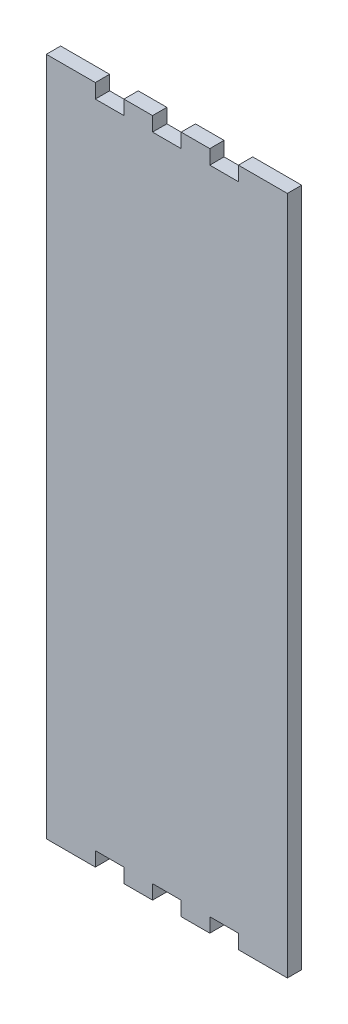
ISO-10303-21;
HEADER;
FILE_DESCRIPTION(('STEP AP214'),'2;1');
FILE_NAME('part.step','',(''),(''),'','','');
FILE_SCHEMA(('AUTOMOTIVE_DESIGN { 1 0 10303 214 1 1 1 1 }'));
ENDSEC;
DATA;
#1=APPLICATION_CONTEXT('core data for automotive mechanical design processes');
#2=APPLICATION_PROTOCOL_DEFINITION('international standard','automotive_design',2000,#1);
#3=PRODUCT_CONTEXT('',#1,'mechanical');
#4=PRODUCT('Part','Part','',(#3));
#5=PRODUCT_RELATED_PRODUCT_CATEGORY('part','',(#4));
#6=PRODUCT_DEFINITION_FORMATION('','',#4);
#7=PRODUCT_DEFINITION_CONTEXT('part definition',#1,'design');
#8=PRODUCT_DEFINITION('design','',#6,#7);
#9=PRODUCT_DEFINITION_SHAPE('','',#8);
#10=(LENGTH_UNIT() NAMED_UNIT(*) SI_UNIT(.MILLI.,.METRE.));
#11=(NAMED_UNIT(*) PLANE_ANGLE_UNIT() SI_UNIT($,.RADIAN.));
#12=(NAMED_UNIT(*) SI_UNIT($,.STERADIAN.) SOLID_ANGLE_UNIT());
#13=UNCERTAINTY_MEASURE_WITH_UNIT(LENGTH_MEASURE(1.E-05),#10,'distance_accuracy_value','');
#14=(GEOMETRIC_REPRESENTATION_CONTEXT(3) GLOBAL_UNCERTAINTY_ASSIGNED_CONTEXT((#13)) GLOBAL_UNIT_ASSIGNED_CONTEXT((#10,
#11,#12)) REPRESENTATION_CONTEXT('',''));
#15=CARTESIAN_POINT('',(0.,0.,0.));
#16=DIRECTION('',(0.,0.,1.));
#17=DIRECTION('',(1.,0.,0.));
#18=AXIS2_PLACEMENT_3D('',#15,#16,#17);
#19=CARTESIAN_POINT('',(980.653875549701,22.8602386986977,5.715));
#20=DIRECTION('',(0.,1.,0.));
#21=DIRECTION('',(0.,0.,1.));
#22=AXIS2_PLACEMENT_3D('',#19,#20,#21);
#23=PLANE('',#22);
#24=DIRECTION('',(1.,0.,0.));
#25=VECTOR('',#24,1.);
#26=CARTESIAN_POINT('',(980.653875549701,22.8602386986977,0.));
#27=LINE('',#26,#25);
#28=CARTESIAN_POINT('',(974.93851469358,22.8602386986977,0.));
#29=VERTEX_POINT('',#28);
#30=CARTESIAN_POINT('',(994.504678765185,22.8602386986977,0.));
#31=VERTEX_POINT('',#30);
#32=EDGE_CURVE('E142',#29,#31,#27,.T.);
#33=ORIENTED_EDGE('',*,*,#32,.T.);
#34=DIRECTION('',(0.,0.,-1.));
#35=VECTOR('',#34,1.);
#36=CARTESIAN_POINT('',(994.504678765185,22.8602386986977,5.715));
#37=LINE('',#36,#35);
#38=CARTESIAN_POINT('',(994.504678765185,22.8602386986977,5.715));
#39=VERTEX_POINT('',#38);
#40=EDGE_CURVE('E11',#39,#31,#37,.T.);
#41=ORIENTED_EDGE('',*,*,#40,.F.);
#42=DIRECTION('',(1.,0.,0.));
#43=VECTOR('',#42,1.);
#44=CARTESIAN_POINT('',(974.93851469358,22.8602386986977,5.715));
#45=LINE('',#44,#43);
#46=CARTESIAN_POINT('',(974.93851469358,22.8602386986977,5.715));
#47=VERTEX_POINT('',#46);
#48=EDGE_CURVE('E147',#47,#39,#45,.T.);
#49=ORIENTED_EDGE('',*,*,#48,.F.);
#50=DIRECTION('',(0.,0.,-1.));
#51=VECTOR('',#50,1.);
#52=CARTESIAN_POINT('',(974.93851469358,22.8602386986977,5.715));
#53=LINE('',#52,#51);
#54=EDGE_CURVE('E246',#47,#29,#53,.T.);
#55=ORIENTED_EDGE('',*,*,#54,.T.);
#56=EDGE_LOOP('',(#33,#41,#49,#55));
#57=FACE_BOUND('',#56,.T.);
#58=ADVANCED_FACE('F34',(#57),#23,.F.);
#59=CARTESIAN_POINT('',(994.504678765185,22.8602386986977,5.715));
#60=DIRECTION('',(-1.,0.,0.));
#61=DIRECTION('',(0.,0.,1.));
#62=AXIS2_PLACEMENT_3D('',#59,#60,#61);
#63=PLANE('',#62);
#64=DIRECTION('',(0.,1.,0.));
#65=VECTOR('',#64,1.);
#66=CARTESIAN_POINT('',(994.504678765185,22.8602386986977,0.));
#67=LINE('',#66,#65);
#68=CARTESIAN_POINT('',(994.504678765185,28.5752452237052,0.));
#69=VERTEX_POINT('',#68);
#70=EDGE_CURVE('E251',#31,#69,#67,.T.);
#71=ORIENTED_EDGE('',*,*,#70,.T.);
#72=DIRECTION('',(0.,0.,-1.));
#73=VECTOR('',#72,1.);
#74=CARTESIAN_POINT('',(994.504678765185,28.5752452237052,5.715));
#75=LINE('',#74,#73);
#76=CARTESIAN_POINT('',(994.504678765185,28.5752452237052,5.715));
#77=VERTEX_POINT('',#76);
#78=EDGE_CURVE('E42',#77,#69,#75,.T.);
#79=ORIENTED_EDGE('',*,*,#78,.F.);
#80=DIRECTION('',(0.,1.,0.));
#81=VECTOR('',#80,1.);
#82=CARTESIAN_POINT('',(994.504678765185,22.8602386986977,5.715));
#83=LINE('',#82,#81);
#84=EDGE_CURVE('E454',#39,#77,#83,.T.);
#85=ORIENTED_EDGE('',*,*,#84,.F.);
#86=ORIENTED_EDGE('',*,*,#40,.T.);
#87=EDGE_LOOP('',(#71,#79,#85,#86));
#88=FACE_BOUND('',#87,.T.);
#89=ADVANCED_FACE('F457',(#88),#63,.F.);
#90=CARTESIAN_POINT('',(994.504678765185,28.5752452237052,5.715));
#91=DIRECTION('',(0.,1.,0.));
#92=DIRECTION('',(0.,0.,1.));
#93=AXIS2_PLACEMENT_3D('',#90,#91,#92);
#94=PLANE('',#93);
#95=DIRECTION('',(1.,0.,0.));
#96=VECTOR('',#95,1.);
#97=CARTESIAN_POINT('',(994.504678765185,28.5752452237052,0.));
#98=LINE('',#97,#96);
#99=CARTESIAN_POINT('',(1005.93540047743,28.5752452237052,0.));
#100=VERTEX_POINT('',#99);
#101=EDGE_CURVE('E253',#69,#100,#98,.T.);
#102=ORIENTED_EDGE('',*,*,#101,.T.);
#103=DIRECTION('',(0.,0.,-1.));
#104=VECTOR('',#103,1.);
#105=CARTESIAN_POINT('',(1005.93540047743,28.5752452237052,5.715));
#106=LINE('',#105,#104);
#107=CARTESIAN_POINT('',(1005.93540047743,28.5752452237052,5.715));
#108=VERTEX_POINT('',#107);
#109=EDGE_CURVE('E373',#108,#100,#106,.T.);
#110=ORIENTED_EDGE('',*,*,#109,.F.);
#111=DIRECTION('',(1.,0.,0.));
#112=VECTOR('',#111,1.);
#113=CARTESIAN_POINT('',(994.504678765185,28.5752452237052,5.715));
#114=LINE('',#113,#112);
#115=EDGE_CURVE('E382',#77,#108,#114,.T.);
#116=ORIENTED_EDGE('',*,*,#115,.F.);
#117=ORIENTED_EDGE('',*,*,#78,.T.);
#118=EDGE_LOOP('',(#102,#110,#116,#117));
#119=FACE_BOUND('',#118,.T.);
#120=ADVANCED_FACE('F380',(#119),#94,.F.);
#121=CARTESIAN_POINT('',(1005.93540047743,28.5752452237052,5.715));
#122=DIRECTION('',(1.,0.,0.));
#123=DIRECTION('',(0.,0.,-1.));
#124=AXIS2_PLACEMENT_3D('',#121,#122,#123);
#125=PLANE('',#124);
#126=DIRECTION('',(0.,-1.,0.));
#127=VECTOR('',#126,1.);
#128=CARTESIAN_POINT('',(1005.93540047743,28.5752452237052,0.));
#129=LINE('',#128,#127);
#130=CARTESIAN_POINT('',(1005.93540047743,22.8602386986977,0.));
#131=VERTEX_POINT('',#130);
#132=EDGE_CURVE('E255',#100,#131,#129,.T.);
#133=ORIENTED_EDGE('',*,*,#132,.T.);
#134=DIRECTION('',(0.,0.,-1.));
#135=VECTOR('',#134,1.);
#136=CARTESIAN_POINT('',(1005.93540047743,22.8602386986977,5.715));
#137=LINE('',#136,#135);
#138=CARTESIAN_POINT('',(1005.93540047743,22.8602386986977,5.715));
#139=VERTEX_POINT('',#138);
#140=EDGE_CURVE('E370',#139,#131,#137,.T.);
#141=ORIENTED_EDGE('',*,*,#140,.F.);
#142=DIRECTION('',(0.,-1.,0.));
#143=VECTOR('',#142,1.);
#144=CARTESIAN_POINT('',(1005.93540047743,28.5752452237052,5.715));
#145=LINE('',#144,#143);
#146=EDGE_CURVE('E400',#108,#139,#145,.T.);
#147=ORIENTED_EDGE('',*,*,#146,.F.);
#148=ORIENTED_EDGE('',*,*,#109,.T.);
#149=EDGE_LOOP('',(#133,#141,#147,#148));
#150=FACE_BOUND('',#149,.T.);
#151=ADVANCED_FACE('F391',(#150),#125,.F.);
#152=CARTESIAN_POINT('',(1005.93540047743,22.8602386986977,5.715));
#153=DIRECTION('',(0.,1.,0.));
#154=DIRECTION('',(0.,0.,1.));
#155=AXIS2_PLACEMENT_3D('',#152,#153,#154);
#156=PLANE('',#155);
#157=DIRECTION('',(1.,0.,0.));
#158=VECTOR('',#157,1.);
#159=CARTESIAN_POINT('',(1005.93540047743,22.8602386986977,0.));
#160=LINE('',#159,#158);
#161=CARTESIAN_POINT('',(1017.36612218967,22.8602386986977,0.));
#162=VERTEX_POINT('',#161);
#163=EDGE_CURVE('E257',#131,#162,#160,.T.);
#164=ORIENTED_EDGE('',*,*,#163,.T.);
#165=DIRECTION('',(0.,0.,-1.));
#166=VECTOR('',#165,1.);
#167=CARTESIAN_POINT('',(1017.36612218967,22.8602386986977,5.715));
#168=LINE('',#167,#166);
#169=CARTESIAN_POINT('',(1017.36612218967,22.8602386986977,5.715));
#170=VERTEX_POINT('',#169);
#171=EDGE_CURVE('E367',#170,#162,#168,.T.);
#172=ORIENTED_EDGE('',*,*,#171,.F.);
#173=DIRECTION('',(1.,0.,0.));
#174=VECTOR('',#173,1.);
#175=CARTESIAN_POINT('',(1005.93540047743,22.8602386986977,5.715));
#176=LINE('',#175,#174);
#177=EDGE_CURVE('E397',#139,#170,#176,.T.);
#178=ORIENTED_EDGE('',*,*,#177,.F.);
#179=ORIENTED_EDGE('',*,*,#140,.T.);
#180=EDGE_LOOP('',(#164,#172,#178,#179));
#181=FACE_BOUND('',#180,.T.);
#182=ADVANCED_FACE('F395',(#181),#156,.F.);
#183=CARTESIAN_POINT('',(1017.36612218967,22.8602386986977,5.715));
#184=DIRECTION('',(-1.,0.,0.));
#185=DIRECTION('',(0.,0.,1.));
#186=AXIS2_PLACEMENT_3D('',#183,#184,#185);
#187=PLANE('',#186);
#188=DIRECTION('',(0.,1.,0.));
#189=VECTOR('',#188,1.);
#190=CARTESIAN_POINT('',(1017.36612218967,22.8602386986977,0.));
#191=LINE('',#190,#189);
#192=CARTESIAN_POINT('',(1017.36612218967,28.5752452237052,0.));
#193=VERTEX_POINT('',#192);
#194=EDGE_CURVE('E259',#162,#193,#191,.T.);
#195=ORIENTED_EDGE('',*,*,#194,.T.);
#196=DIRECTION('',(0.,0.,-1.));
#197=VECTOR('',#196,1.);
#198=CARTESIAN_POINT('',(1017.36612218967,28.5752452237052,5.715));
#199=LINE('',#198,#197);
#200=CARTESIAN_POINT('',(1017.36612218967,28.5752452237052,5.715));
#201=VERTEX_POINT('',#200);
#202=EDGE_CURVE('E364',#201,#193,#199,.T.);
#203=ORIENTED_EDGE('',*,*,#202,.F.);
#204=DIRECTION('',(0.,1.,0.));
#205=VECTOR('',#204,1.);
#206=CARTESIAN_POINT('',(1017.36612218967,22.8602386986977,5.715));
#207=LINE('',#206,#205);
#208=EDGE_CURVE('E399',#170,#201,#207,.T.);
#209=ORIENTED_EDGE('',*,*,#208,.F.);
#210=ORIENTED_EDGE('',*,*,#171,.T.);
#211=EDGE_LOOP('',(#195,#203,#209,#210));
#212=FACE_BOUND('',#211,.T.);
#213=ADVANCED_FACE('F469',(#212),#187,.F.);
#214=CARTESIAN_POINT('',(1017.36612218967,28.5752452237052,5.715));
#215=DIRECTION('',(0.,1.,0.));
#216=DIRECTION('',(0.,0.,1.));
#217=AXIS2_PLACEMENT_3D('',#214,#215,#216);
#218=PLANE('',#217);
#219=DIRECTION('',(1.,0.,0.));
#220=VECTOR('',#219,1.);
#221=CARTESIAN_POINT('',(1017.36612218967,28.5752452237052,0.));
#222=LINE('',#221,#220);
#223=CARTESIAN_POINT('',(1028.79684390191,28.5752452237052,0.));
#224=VERTEX_POINT('',#223);
#225=EDGE_CURVE('E261',#193,#224,#222,.T.);
#226=ORIENTED_EDGE('',*,*,#225,.T.);
#227=DIRECTION('',(0.,0.,-1.));
#228=VECTOR('',#227,1.);
#229=CARTESIAN_POINT('',(1028.79684390191,28.5752452237052,5.715));
#230=LINE('',#229,#228);
#231=CARTESIAN_POINT('',(1028.79684390191,28.5752452237052,5.715));
#232=VERTEX_POINT('',#231);
#233=EDGE_CURVE('E361',#232,#224,#230,.T.);
#234=ORIENTED_EDGE('',*,*,#233,.F.);
#235=DIRECTION('',(1.,0.,0.));
#236=VECTOR('',#235,1.);
#237=CARTESIAN_POINT('',(1017.36612218967,28.5752452237052,5.715));
#238=LINE('',#237,#236);
#239=EDGE_CURVE('E402',#201,#232,#238,.T.);
#240=ORIENTED_EDGE('',*,*,#239,.F.);
#241=ORIENTED_EDGE('',*,*,#202,.T.);
#242=EDGE_LOOP('',(#226,#234,#240,#241));
#243=FACE_BOUND('',#242,.T.);
#244=ADVANCED_FACE('F472',(#243),#218,.F.);
#245=CARTESIAN_POINT('',(1028.79684390191,28.5752452237052,5.715));
#246=DIRECTION('',(1.,0.,0.));
#247=DIRECTION('',(0.,0.,-1.));
#248=AXIS2_PLACEMENT_3D('',#245,#246,#247);
#249=PLANE('',#248);
#250=DIRECTION('',(0.,-1.,0.));
#251=VECTOR('',#250,1.);
#252=CARTESIAN_POINT('',(1028.79684390191,28.5752452237052,0.));
#253=LINE('',#252,#251);
#254=CARTESIAN_POINT('',(1028.79684390191,22.8602386986977,0.));
#255=VERTEX_POINT('',#254);
#256=EDGE_CURVE('E263',#224,#255,#253,.T.);
#257=ORIENTED_EDGE('',*,*,#256,.T.);
#258=DIRECTION('',(0.,0.,-1.));
#259=VECTOR('',#258,1.);
#260=CARTESIAN_POINT('',(1028.79684390191,22.8602386986977,5.715));
#261=LINE('',#260,#259);
#262=CARTESIAN_POINT('',(1028.79684390191,22.8602386986977,5.715));
#263=VERTEX_POINT('',#262);
#264=EDGE_CURVE('E358',#263,#255,#261,.T.);
#265=ORIENTED_EDGE('',*,*,#264,.F.);
#266=DIRECTION('',(0.,-1.,0.));
#267=VECTOR('',#266,1.);
#268=CARTESIAN_POINT('',(1028.79684390191,28.5752452237052,5.715));
#269=LINE('',#268,#267);
#270=EDGE_CURVE('E408',#232,#263,#269,.T.);
#271=ORIENTED_EDGE('',*,*,#270,.F.);
#272=ORIENTED_EDGE('',*,*,#233,.T.);
#273=EDGE_LOOP('',(#257,#265,#271,#272));
#274=FACE_BOUND('',#273,.T.);
#275=ADVANCED_FACE('F476',(#274),#249,.F.);
#276=CARTESIAN_POINT('',(1028.79684390191,22.8602386986977,5.715));
#277=DIRECTION('',(0.,1.,0.));
#278=DIRECTION('',(0.,0.,1.));
#279=AXIS2_PLACEMENT_3D('',#276,#277,#278);
#280=PLANE('',#279);
#281=DIRECTION('',(1.,0.,0.));
#282=VECTOR('',#281,1.);
#283=CARTESIAN_POINT('',(1028.79684390191,22.8602386986977,0.));
#284=LINE('',#283,#282);
#285=CARTESIAN_POINT('',(1040.22402230302,22.8602386986977,0.));
#286=VERTEX_POINT('',#285);
#287=EDGE_CURVE('E265',#255,#286,#284,.T.);
#288=ORIENTED_EDGE('',*,*,#287,.T.);
#289=DIRECTION('',(0.,0.,-1.));
#290=VECTOR('',#289,1.);
#291=CARTESIAN_POINT('',(1040.22402230302,22.8602386986977,5.715));
#292=LINE('',#291,#290);
#293=CARTESIAN_POINT('',(1040.22402230302,22.8602386986977,5.715));
#294=VERTEX_POINT('',#293);
#295=EDGE_CURVE('E355',#294,#286,#292,.T.);
#296=ORIENTED_EDGE('',*,*,#295,.F.);
#297=DIRECTION('',(1.,0.,0.));
#298=VECTOR('',#297,1.);
#299=CARTESIAN_POINT('',(1028.79684390191,22.8602386986977,5.715));
#300=LINE('',#299,#298);
#301=EDGE_CURVE('E410',#263,#294,#300,.T.);
#302=ORIENTED_EDGE('',*,*,#301,.F.);
#303=ORIENTED_EDGE('',*,*,#264,.T.);
#304=EDGE_LOOP('',(#288,#296,#302,#303));
#305=FACE_BOUND('',#304,.T.);
#306=ADVANCED_FACE('F480',(#305),#280,.F.);
#307=CARTESIAN_POINT('',(1040.22402230302,22.8602386986977,5.715));
#308=DIRECTION('',(-1.,0.,0.));
#309=DIRECTION('',(0.,0.,1.));
#310=AXIS2_PLACEMENT_3D('',#307,#308,#309);
#311=PLANE('',#310);
#312=DIRECTION('',(0.,1.,0.));
#313=VECTOR('',#312,1.);
#314=CARTESIAN_POINT('',(1040.22402230302,22.8602386986977,0.));
#315=LINE('',#314,#313);
#316=CARTESIAN_POINT('',(1040.22402230302,28.5752452237052,0.));
#317=VERTEX_POINT('',#316);
#318=EDGE_CURVE('E267',#286,#317,#315,.T.);
#319=ORIENTED_EDGE('',*,*,#318,.T.);
#320=DIRECTION('',(0.,0.,-1.));
#321=VECTOR('',#320,1.);
#322=CARTESIAN_POINT('',(1040.22402230302,28.5752452237052,5.715));
#323=LINE('',#322,#321);
#324=CARTESIAN_POINT('',(1040.22402230302,28.5752452237052,5.715));
#325=VERTEX_POINT('',#324);
#326=EDGE_CURVE('E352',#325,#317,#323,.T.);
#327=ORIENTED_EDGE('',*,*,#326,.F.);
#328=DIRECTION('',(0.,1.,0.));
#329=VECTOR('',#328,1.);
#330=CARTESIAN_POINT('',(1040.22402230302,22.8602386986977,5.715));
#331=LINE('',#330,#329);
#332=EDGE_CURVE('E412',#294,#325,#331,.T.);
#333=ORIENTED_EDGE('',*,*,#332,.F.);
#334=ORIENTED_EDGE('',*,*,#295,.T.);
#335=EDGE_LOOP('',(#319,#327,#333,#334));
#336=FACE_BOUND('',#335,.T.);
#337=ADVANCED_FACE('F484',(#336),#311,.F.);
#338=CARTESIAN_POINT('',(1040.22402230302,28.5752452237052,5.715));
#339=DIRECTION('',(0.,1.,0.));
#340=DIRECTION('',(0.,0.,1.));
#341=AXIS2_PLACEMENT_3D('',#338,#339,#340);
#342=PLANE('',#341);
#343=DIRECTION('',(1.,0.,0.));
#344=VECTOR('',#343,1.);
#345=CARTESIAN_POINT('',(1040.22402230302,28.5752452237052,0.));
#346=LINE('',#345,#344);
#347=CARTESIAN_POINT('',(1051.65474401526,28.5752452237052,0.));
#348=VERTEX_POINT('',#347);
#349=EDGE_CURVE('E269',#317,#348,#346,.T.);
#350=ORIENTED_EDGE('',*,*,#349,.T.);
#351=DIRECTION('',(0.,0.,-1.));
#352=VECTOR('',#351,1.);
#353=CARTESIAN_POINT('',(1051.65474401526,28.5752452237052,5.715));
#354=LINE('',#353,#352);
#355=CARTESIAN_POINT('',(1051.65474401526,28.5752452237052,5.715));
#356=VERTEX_POINT('',#355);
#357=EDGE_CURVE('E349',#356,#348,#354,.T.);
#358=ORIENTED_EDGE('',*,*,#357,.F.);
#359=DIRECTION('',(1.,0.,0.));
#360=VECTOR('',#359,1.);
#361=CARTESIAN_POINT('',(1040.22402230302,28.5752452237052,5.715));
#362=LINE('',#361,#360);
#363=EDGE_CURVE('E414',#325,#356,#362,.T.);
#364=ORIENTED_EDGE('',*,*,#363,.F.);
#365=ORIENTED_EDGE('',*,*,#326,.T.);
#366=EDGE_LOOP('',(#350,#358,#364,#365));
#367=FACE_BOUND('',#366,.T.);
#368=ADVANCED_FACE('F488',(#367),#342,.F.);
#369=CARTESIAN_POINT('',(1051.65474401526,28.5752452237052,5.715));
#370=DIRECTION('',(1.,0.,0.));
#371=DIRECTION('',(0.,0.,-1.));
#372=AXIS2_PLACEMENT_3D('',#369,#370,#371);
#373=PLANE('',#372);
#374=DIRECTION('',(0.,-1.,0.));
#375=VECTOR('',#374,1.);
#376=CARTESIAN_POINT('',(1051.65474401526,28.5752452237052,0.));
#377=LINE('',#376,#375);
#378=CARTESIAN_POINT('',(1051.65474401526,22.8602386986977,0.));
#379=VERTEX_POINT('',#378);
#380=EDGE_CURVE('E271',#348,#379,#377,.T.);
#381=ORIENTED_EDGE('',*,*,#380,.T.);
#382=DIRECTION('',(0.,0.,-1.));
#383=VECTOR('',#382,1.);
#384=CARTESIAN_POINT('',(1051.65474401526,22.8602386986977,5.715));
#385=LINE('',#384,#383);
#386=CARTESIAN_POINT('',(1051.65474401526,22.8602386986977,5.715));
#387=VERTEX_POINT('',#386);
#388=EDGE_CURVE('E346',#387,#379,#385,.T.);
#389=ORIENTED_EDGE('',*,*,#388,.F.);
#390=DIRECTION('',(0.,-1.,0.));
#391=VECTOR('',#390,1.);
#392=CARTESIAN_POINT('',(1051.65474401526,28.5752452237052,5.715));
#393=LINE('',#392,#391);
#394=EDGE_CURVE('E416',#356,#387,#393,.T.);
#395=ORIENTED_EDGE('',*,*,#394,.F.);
#396=ORIENTED_EDGE('',*,*,#357,.T.);
#397=EDGE_LOOP('',(#381,#389,#395,#396));
#398=FACE_BOUND('',#397,.T.);
#399=ADVANCED_FACE('F492',(#398),#373,.F.);
#400=CARTESIAN_POINT('',(1065.50909054188,22.8602386986977,5.715));
#401=DIRECTION('',(0.,1.,0.));
#402=DIRECTION('',(0.,0.,1.));
#403=AXIS2_PLACEMENT_3D('',#400,#401,#402);
#404=PLANE('',#403);
#405=DIRECTION('',(1.,0.,0.));
#406=VECTOR('',#405,1.);
#407=CARTESIAN_POINT('',(1065.50909054188,22.8602386986977,0.));
#408=LINE('',#407,#406);
#409=CARTESIAN_POINT('',(1071.22090808686,22.8602386986977,0.));
#410=VERTEX_POINT('',#409);
#411=EDGE_CURVE('E274',#379,#410,#408,.T.);
#412=ORIENTED_EDGE('',*,*,#411,.T.);
#413=DIRECTION('',(0.,0.,-1.));
#414=VECTOR('',#413,1.);
#415=CARTESIAN_POINT('',(1071.22090808686,22.8602386986977,5.715));
#416=LINE('',#415,#414);
#417=CARTESIAN_POINT('',(1071.22090808686,22.8602386986977,5.715));
#418=VERTEX_POINT('',#417);
#419=EDGE_CURVE('E343',#418,#410,#416,.T.);
#420=ORIENTED_EDGE('',*,*,#419,.F.);
#421=DIRECTION('',(1.,0.,0.));
#422=VECTOR('',#421,1.);
#423=CARTESIAN_POINT('',(1051.65474401526,22.8602386986977,5.715));
#424=LINE('',#423,#422);
#425=EDGE_CURVE('E418',#387,#418,#424,.T.);
#426=ORIENTED_EDGE('',*,*,#425,.F.);
#427=ORIENTED_EDGE('',*,*,#388,.T.);
#428=EDGE_LOOP('',(#412,#420,#426,#427));
#429=FACE_BOUND('',#428,.T.);
#430=ADVANCED_FACE('F496',(#429),#404,.F.);
#431=CARTESIAN_POINT('',(1071.22090808686,288.575408216017,5.715));
#432=DIRECTION('',(-1.,0.,0.));
#433=DIRECTION('',(0.,0.,1.));
#434=AXIS2_PLACEMENT_3D('',#431,#432,#433);
#435=PLANE('',#434);
#436=DIRECTION('',(0.,1.,0.));
#437=VECTOR('',#436,1.);
#438=CARTESIAN_POINT('',(1071.22090808686,288.575408216017,0.));
#439=LINE('',#438,#437);
#440=CARTESIAN_POINT('',(1071.22090808686,294.290414741025,0.));
#441=VERTEX_POINT('',#440);
#442=EDGE_CURVE('E277',#410,#441,#439,.T.);
#443=ORIENTED_EDGE('',*,*,#442,.T.);
#444=DIRECTION('',(0.,0.,-1.));
#445=VECTOR('',#444,1.);
#446=CARTESIAN_POINT('',(1071.22090808686,294.290414741025,5.715));
#447=LINE('',#446,#445);
#448=CARTESIAN_POINT('',(1071.22090808686,294.290414741025,5.715));
#449=VERTEX_POINT('',#448);
#450=EDGE_CURVE('E340',#449,#441,#447,.T.);
#451=ORIENTED_EDGE('',*,*,#450,.F.);
#452=DIRECTION('',(0.,1.,0.));
#453=VECTOR('',#452,1.);
#454=CARTESIAN_POINT('',(1071.22090808686,22.8602386986977,5.715));
#455=LINE('',#454,#453);
#456=EDGE_CURVE('E420',#418,#449,#455,.T.);
#457=ORIENTED_EDGE('',*,*,#456,.F.);
#458=ORIENTED_EDGE('',*,*,#419,.T.);
#459=EDGE_LOOP('',(#443,#451,#457,#458));
#460=FACE_BOUND('',#459,.T.);
#461=ADVANCED_FACE('F500',(#460),#435,.F.);
#462=CARTESIAN_POINT('',(1065.50909054188,294.290414741025,5.715));
#463=DIRECTION('',(0.,-1.,0.));
#464=DIRECTION('',(0.,0.,-1.));
#465=AXIS2_PLACEMENT_3D('',#462,#463,#464);
#466=PLANE('',#465);
#467=DIRECTION('',(-1.,0.,0.));
#468=VECTOR('',#467,1.);
#469=CARTESIAN_POINT('',(1065.50909054188,294.290414741025,0.));
#470=LINE('',#469,#468);
#471=CARTESIAN_POINT('',(1051.65474401526,294.290414741025,0.));
#472=VERTEX_POINT('',#471);
#473=EDGE_CURVE('E280',#441,#472,#470,.T.);
#474=ORIENTED_EDGE('',*,*,#473,.T.);
#475=DIRECTION('',(0.,0.,-1.));
#476=VECTOR('',#475,1.);
#477=CARTESIAN_POINT('',(1051.65474401526,294.290414741025,5.715));
#478=LINE('',#477,#476);
#479=CARTESIAN_POINT('',(1051.65474401526,294.290414741025,5.715));
#480=VERTEX_POINT('',#479);
#481=EDGE_CURVE('E337',#480,#472,#478,.T.);
#482=ORIENTED_EDGE('',*,*,#481,.F.);
#483=DIRECTION('',(-1.,0.,0.));
#484=VECTOR('',#483,1.);
#485=CARTESIAN_POINT('',(1071.22090808686,294.290414741025,5.715));
#486=LINE('',#485,#484);
#487=EDGE_CURVE('E422',#449,#480,#486,.T.);
#488=ORIENTED_EDGE('',*,*,#487,.F.);
#489=ORIENTED_EDGE('',*,*,#450,.T.);
#490=EDGE_LOOP('',(#474,#482,#488,#489));
#491=FACE_BOUND('',#490,.T.);
#492=ADVANCED_FACE('F504',(#491),#466,.F.);
#493=CARTESIAN_POINT('',(1051.65474401526,294.290414741025,5.715));
#494=DIRECTION('',(1.,0.,0.));
#495=DIRECTION('',(0.,0.,-1.));
#496=AXIS2_PLACEMENT_3D('',#493,#494,#495);
#497=PLANE('',#496);
#498=DIRECTION('',(0.,-1.,0.));
#499=VECTOR('',#498,1.);
#500=CARTESIAN_POINT('',(1051.65474401526,294.290414741025,0.));
#501=LINE('',#500,#499);
#502=CARTESIAN_POINT('',(1051.65474401526,288.575408216017,0.));
#503=VERTEX_POINT('',#502);
#504=EDGE_CURVE('E282',#472,#503,#501,.T.);
#505=ORIENTED_EDGE('',*,*,#504,.T.);
#506=DIRECTION('',(0.,0.,-1.));
#507=VECTOR('',#506,1.);
#508=CARTESIAN_POINT('',(1051.65474401526,288.575408216017,5.715));
#509=LINE('',#508,#507);
#510=CARTESIAN_POINT('',(1051.65474401526,288.575408216017,5.715));
#511=VERTEX_POINT('',#510);
#512=EDGE_CURVE('E334',#511,#503,#509,.T.);
#513=ORIENTED_EDGE('',*,*,#512,.F.);
#514=DIRECTION('',(0.,-1.,0.));
#515=VECTOR('',#514,1.);
#516=CARTESIAN_POINT('',(1051.65474401526,294.290414741025,5.715));
#517=LINE('',#516,#515);
#518=EDGE_CURVE('E424',#480,#511,#517,.T.);
#519=ORIENTED_EDGE('',*,*,#518,.F.);
#520=ORIENTED_EDGE('',*,*,#481,.T.);
#521=EDGE_LOOP('',(#505,#513,#519,#520));
#522=FACE_BOUND('',#521,.T.);
#523=ADVANCED_FACE('F508',(#522),#497,.F.);
#524=CARTESIAN_POINT('',(1051.65474401526,288.575408216017,5.715));
#525=DIRECTION('',(0.,-1.,0.));
#526=DIRECTION('',(0.,0.,-1.));
#527=AXIS2_PLACEMENT_3D('',#524,#525,#526);
#528=PLANE('',#527);
#529=DIRECTION('',(-1.,0.,0.));
#530=VECTOR('',#529,1.);
#531=CARTESIAN_POINT('',(1051.65474401526,288.575408216017,0.));
#532=LINE('',#531,#530);
#533=CARTESIAN_POINT('',(1040.22402230302,288.575408216017,0.));
#534=VERTEX_POINT('',#533);
#535=EDGE_CURVE('E284',#503,#534,#532,.T.);
#536=ORIENTED_EDGE('',*,*,#535,.T.);
#537=DIRECTION('',(0.,0.,-1.));
#538=VECTOR('',#537,1.);
#539=CARTESIAN_POINT('',(1040.22402230302,288.575408216017,5.715));
#540=LINE('',#539,#538);
#541=CARTESIAN_POINT('',(1040.22402230302,288.575408216017,5.715));
#542=VERTEX_POINT('',#541);
#543=EDGE_CURVE('E331',#542,#534,#540,.T.);
#544=ORIENTED_EDGE('',*,*,#543,.F.);
#545=DIRECTION('',(-1.,0.,0.));
#546=VECTOR('',#545,1.);
#547=CARTESIAN_POINT('',(1051.65474401526,288.575408216017,5.715));
#548=LINE('',#547,#546);
#549=EDGE_CURVE('E426',#511,#542,#548,.T.);
#550=ORIENTED_EDGE('',*,*,#549,.F.);
#551=ORIENTED_EDGE('',*,*,#512,.T.);
#552=EDGE_LOOP('',(#536,#544,#550,#551));
#553=FACE_BOUND('',#552,.T.);
#554=ADVANCED_FACE('F512',(#553),#528,.F.);
#555=CARTESIAN_POINT('',(1040.22402230302,288.575408216017,5.715));
#556=DIRECTION('',(-1.,0.,0.));
#557=DIRECTION('',(0.,0.,1.));
#558=AXIS2_PLACEMENT_3D('',#555,#556,#557);
#559=PLANE('',#558);
#560=DIRECTION('',(0.,1.,0.));
#561=VECTOR('',#560,1.);
#562=CARTESIAN_POINT('',(1040.22402230302,288.575408216017,0.));
#563=LINE('',#562,#561);
#564=CARTESIAN_POINT('',(1040.22402230302,294.290414741025,0.));
#565=VERTEX_POINT('',#564);
#566=EDGE_CURVE('E286',#534,#565,#563,.T.);
#567=ORIENTED_EDGE('',*,*,#566,.T.);
#568=DIRECTION('',(0.,0.,-1.));
#569=VECTOR('',#568,1.);
#570=CARTESIAN_POINT('',(1040.22402230302,294.290414741025,5.715));
#571=LINE('',#570,#569);
#572=CARTESIAN_POINT('',(1040.22402230302,294.290414741025,5.715));
#573=VERTEX_POINT('',#572);
#574=EDGE_CURVE('E328',#573,#565,#571,.T.);
#575=ORIENTED_EDGE('',*,*,#574,.F.);
#576=DIRECTION('',(0.,1.,0.));
#577=VECTOR('',#576,1.);
#578=CARTESIAN_POINT('',(1040.22402230302,288.575408216017,5.715));
#579=LINE('',#578,#577);
#580=EDGE_CURVE('E428',#542,#573,#579,.T.);
#581=ORIENTED_EDGE('',*,*,#580,.F.);
#582=ORIENTED_EDGE('',*,*,#543,.T.);
#583=EDGE_LOOP('',(#567,#575,#581,#582));
#584=FACE_BOUND('',#583,.T.);
#585=ADVANCED_FACE('F516',(#584),#559,.F.);
#586=CARTESIAN_POINT('',(1040.22402230302,294.290414741025,5.715));
#587=DIRECTION('',(0.,-1.,0.));
#588=DIRECTION('',(0.,0.,-1.));
#589=AXIS2_PLACEMENT_3D('',#586,#587,#588);
#590=PLANE('',#589);
#591=DIRECTION('',(-1.,0.,0.));
#592=VECTOR('',#591,1.);
#593=CARTESIAN_POINT('',(1040.22402230302,294.290414741025,0.));
#594=LINE('',#593,#592);
#595=CARTESIAN_POINT('',(1028.79684390191,294.290414741025,0.));
#596=VERTEX_POINT('',#595);
#597=EDGE_CURVE('E288',#565,#596,#594,.T.);
#598=ORIENTED_EDGE('',*,*,#597,.T.);
#599=DIRECTION('',(0.,0.,-1.));
#600=VECTOR('',#599,1.);
#601=CARTESIAN_POINT('',(1028.79684390191,294.290414741025,5.715));
#602=LINE('',#601,#600);
#603=CARTESIAN_POINT('',(1028.79684390191,294.290414741025,5.715));
#604=VERTEX_POINT('',#603);
#605=EDGE_CURVE('E325',#604,#596,#602,.T.);
#606=ORIENTED_EDGE('',*,*,#605,.F.);
#607=DIRECTION('',(-1.,0.,0.));
#608=VECTOR('',#607,1.);
#609=CARTESIAN_POINT('',(1040.22402230302,294.290414741025,5.715));
#610=LINE('',#609,#608);
#611=EDGE_CURVE('E430',#573,#604,#610,.T.);
#612=ORIENTED_EDGE('',*,*,#611,.F.);
#613=ORIENTED_EDGE('',*,*,#574,.T.);
#614=EDGE_LOOP('',(#598,#606,#612,#613));
#615=FACE_BOUND('',#614,.T.);
#616=ADVANCED_FACE('F520',(#615),#590,.F.);
#617=CARTESIAN_POINT('',(1028.79684390191,294.290414741025,5.715));
#618=DIRECTION('',(1.,0.,0.));
#619=DIRECTION('',(0.,0.,-1.));
#620=AXIS2_PLACEMENT_3D('',#617,#618,#619);
#621=PLANE('',#620);
#622=DIRECTION('',(0.,-1.,0.));
#623=VECTOR('',#622,1.);
#624=CARTESIAN_POINT('',(1028.79684390191,294.290414741025,0.));
#625=LINE('',#624,#623);
#626=CARTESIAN_POINT('',(1028.79684390191,288.575408216017,0.));
#627=VERTEX_POINT('',#626);
#628=EDGE_CURVE('E290',#596,#627,#625,.T.);
#629=ORIENTED_EDGE('',*,*,#628,.T.);
#630=DIRECTION('',(0.,0.,-1.));
#631=VECTOR('',#630,1.);
#632=CARTESIAN_POINT('',(1028.79684390191,288.575408216017,5.715));
#633=LINE('',#632,#631);
#634=CARTESIAN_POINT('',(1028.79684390191,288.575408216017,5.715));
#635=VERTEX_POINT('',#634);
#636=EDGE_CURVE('E322',#635,#627,#633,.T.);
#637=ORIENTED_EDGE('',*,*,#636,.F.);
#638=DIRECTION('',(0.,-1.,0.));
#639=VECTOR('',#638,1.);
#640=CARTESIAN_POINT('',(1028.79684390191,294.290414741025,5.715));
#641=LINE('',#640,#639);
#642=EDGE_CURVE('E432',#604,#635,#641,.T.);
#643=ORIENTED_EDGE('',*,*,#642,.F.);
#644=ORIENTED_EDGE('',*,*,#605,.T.);
#645=EDGE_LOOP('',(#629,#637,#643,#644));
#646=FACE_BOUND('',#645,.T.);
#647=ADVANCED_FACE('F524',(#646),#621,.F.);
#648=CARTESIAN_POINT('',(1028.79684390191,288.575408216017,5.715));
#649=DIRECTION('',(0.,-1.,0.));
#650=DIRECTION('',(0.,0.,-1.));
#651=AXIS2_PLACEMENT_3D('',#648,#649,#650);
#652=PLANE('',#651);
#653=DIRECTION('',(-1.,0.,0.));
#654=VECTOR('',#653,1.);
#655=CARTESIAN_POINT('',(1028.79684390191,288.575408216017,0.));
#656=LINE('',#655,#654);
#657=CARTESIAN_POINT('',(1017.36612218967,288.575408216017,0.));
#658=VERTEX_POINT('',#657);
#659=EDGE_CURVE('E292',#627,#658,#656,.T.);
#660=ORIENTED_EDGE('',*,*,#659,.T.);
#661=DIRECTION('',(0.,0.,-1.));
#662=VECTOR('',#661,1.);
#663=CARTESIAN_POINT('',(1017.36612218967,288.575408216017,5.715));
#664=LINE('',#663,#662);
#665=CARTESIAN_POINT('',(1017.36612218967,288.575408216017,5.715));
#666=VERTEX_POINT('',#665);
#667=EDGE_CURVE('E319',#666,#658,#664,.T.);
#668=ORIENTED_EDGE('',*,*,#667,.F.);
#669=DIRECTION('',(-1.,0.,0.));
#670=VECTOR('',#669,1.);
#671=CARTESIAN_POINT('',(1028.79684390191,288.575408216017,5.715));
#672=LINE('',#671,#670);
#673=EDGE_CURVE('E434',#635,#666,#672,.T.);
#674=ORIENTED_EDGE('',*,*,#673,.F.);
#675=ORIENTED_EDGE('',*,*,#636,.T.);
#676=EDGE_LOOP('',(#660,#668,#674,#675));
#677=FACE_BOUND('',#676,.T.);
#678=ADVANCED_FACE('F528',(#677),#652,.F.);
#679=CARTESIAN_POINT('',(1017.36612218967,288.575408216017,5.715));
#680=DIRECTION('',(-1.,0.,0.));
#681=DIRECTION('',(0.,0.,1.));
#682=AXIS2_PLACEMENT_3D('',#679,#680,#681);
#683=PLANE('',#682);
#684=DIRECTION('',(0.,1.,0.));
#685=VECTOR('',#684,1.);
#686=CARTESIAN_POINT('',(1017.36612218967,288.575408216017,0.));
#687=LINE('',#686,#685);
#688=CARTESIAN_POINT('',(1017.36612218967,294.290414741025,0.));
#689=VERTEX_POINT('',#688);
#690=EDGE_CURVE('E294',#658,#689,#687,.T.);
#691=ORIENTED_EDGE('',*,*,#690,.T.);
#692=DIRECTION('',(0.,0.,-1.));
#693=VECTOR('',#692,1.);
#694=CARTESIAN_POINT('',(1017.36612218967,294.290414741025,5.715));
#695=LINE('',#694,#693);
#696=CARTESIAN_POINT('',(1017.36612218967,294.290414741025,5.715));
#697=VERTEX_POINT('',#696);
#698=EDGE_CURVE('E316',#697,#689,#695,.T.);
#699=ORIENTED_EDGE('',*,*,#698,.F.);
#700=DIRECTION('',(0.,1.,0.));
#701=VECTOR('',#700,1.);
#702=CARTESIAN_POINT('',(1017.36612218967,288.575408216017,5.715));
#703=LINE('',#702,#701);
#704=EDGE_CURVE('E436',#666,#697,#703,.T.);
#705=ORIENTED_EDGE('',*,*,#704,.F.);
#706=ORIENTED_EDGE('',*,*,#667,.T.);
#707=EDGE_LOOP('',(#691,#699,#705,#706));
#708=FACE_BOUND('',#707,.T.);
#709=ADVANCED_FACE('F532',(#708),#683,.F.);
#710=CARTESIAN_POINT('',(1017.36612218967,294.290414741025,5.715));
#711=DIRECTION('',(0.,-1.,0.));
#712=DIRECTION('',(0.,0.,-1.));
#713=AXIS2_PLACEMENT_3D('',#710,#711,#712);
#714=PLANE('',#713);
#715=DIRECTION('',(-1.,0.,0.));
#716=VECTOR('',#715,1.);
#717=CARTESIAN_POINT('',(1017.36612218967,294.290414741025,0.));
#718=LINE('',#717,#716);
#719=CARTESIAN_POINT('',(1005.93540047743,294.290414741025,0.));
#720=VERTEX_POINT('',#719);
#721=EDGE_CURVE('E296',#689,#720,#718,.T.);
#722=ORIENTED_EDGE('',*,*,#721,.T.);
#723=DIRECTION('',(0.,0.,-1.));
#724=VECTOR('',#723,1.);
#725=CARTESIAN_POINT('',(1005.93540047743,294.290414741025,5.715));
#726=LINE('',#725,#724);
#727=CARTESIAN_POINT('',(1005.93540047743,294.290414741025,5.715));
#728=VERTEX_POINT('',#727);
#729=EDGE_CURVE('E313',#728,#720,#726,.T.);
#730=ORIENTED_EDGE('',*,*,#729,.F.);
#731=DIRECTION('',(-1.,0.,0.));
#732=VECTOR('',#731,1.);
#733=CARTESIAN_POINT('',(1017.36612218967,294.290414741025,5.715));
#734=LINE('',#733,#732);
#735=EDGE_CURVE('E438',#697,#728,#734,.T.);
#736=ORIENTED_EDGE('',*,*,#735,.F.);
#737=ORIENTED_EDGE('',*,*,#698,.T.);
#738=EDGE_LOOP('',(#722,#730,#736,#737));
#739=FACE_BOUND('',#738,.T.);
#740=ADVANCED_FACE('F536',(#739),#714,.F.);
#741=CARTESIAN_POINT('',(1005.93540047743,294.290414741025,5.715));
#742=DIRECTION('',(1.,0.,0.));
#743=DIRECTION('',(0.,0.,-1.));
#744=AXIS2_PLACEMENT_3D('',#741,#742,#743);
#745=PLANE('',#744);
#746=DIRECTION('',(0.,-1.,0.));
#747=VECTOR('',#746,1.);
#748=CARTESIAN_POINT('',(1005.93540047743,294.290414741025,0.));
#749=LINE('',#748,#747);
#750=CARTESIAN_POINT('',(1005.93540047743,288.575408216017,0.));
#751=VERTEX_POINT('',#750);
#752=EDGE_CURVE('E298',#720,#751,#749,.T.);
#753=ORIENTED_EDGE('',*,*,#752,.T.);
#754=DIRECTION('',(0.,0.,-1.));
#755=VECTOR('',#754,1.);
#756=CARTESIAN_POINT('',(1005.93540047743,288.575408216017,5.715));
#757=LINE('',#756,#755);
#758=CARTESIAN_POINT('',(1005.93540047743,288.575408216017,5.715));
#759=VERTEX_POINT('',#758);
#760=EDGE_CURVE('E310',#759,#751,#757,.T.);
#761=ORIENTED_EDGE('',*,*,#760,.F.);
#762=DIRECTION('',(0.,-1.,0.));
#763=VECTOR('',#762,1.);
#764=CARTESIAN_POINT('',(1005.93540047743,294.290414741025,5.715));
#765=LINE('',#764,#763);
#766=EDGE_CURVE('E440',#728,#759,#765,.T.);
#767=ORIENTED_EDGE('',*,*,#766,.F.);
#768=ORIENTED_EDGE('',*,*,#729,.T.);
#769=EDGE_LOOP('',(#753,#761,#767,#768));
#770=FACE_BOUND('',#769,.T.);
#771=ADVANCED_FACE('F446',(#770),#745,.F.);
#772=CARTESIAN_POINT('',(1005.93540047743,288.575408216017,5.715));
#773=DIRECTION('',(0.,-1.,0.));
#774=DIRECTION('',(0.,0.,-1.));
#775=AXIS2_PLACEMENT_3D('',#772,#773,#774);
#776=PLANE('',#775);
#777=DIRECTION('',(-1.,0.,0.));
#778=VECTOR('',#777,1.);
#779=CARTESIAN_POINT('',(1005.93540047743,288.575408216017,0.));
#780=LINE('',#779,#778);
#781=CARTESIAN_POINT('',(994.504678765185,288.575408216017,0.));
#782=VERTEX_POINT('',#781);
#783=EDGE_CURVE('E300',#751,#782,#780,.T.);
#784=ORIENTED_EDGE('',*,*,#783,.T.);
#785=DIRECTION('',(0.,0.,-1.));
#786=VECTOR('',#785,1.);
#787=CARTESIAN_POINT('',(994.504678765185,288.575408216017,5.715));
#788=LINE('',#787,#786);
#789=CARTESIAN_POINT('',(994.504678765185,288.575408216017,5.715));
#790=VERTEX_POINT('',#789);
#791=EDGE_CURVE('E240',#790,#782,#788,.T.);
#792=ORIENTED_EDGE('',*,*,#791,.F.);
#793=DIRECTION('',(-1.,0.,0.));
#794=VECTOR('',#793,1.);
#795=CARTESIAN_POINT('',(1005.93540047743,288.575408216017,5.715));
#796=LINE('',#795,#794);
#797=EDGE_CURVE('E228',#759,#790,#796,.T.);
#798=ORIENTED_EDGE('',*,*,#797,.F.);
#799=ORIENTED_EDGE('',*,*,#760,.T.);
#800=EDGE_LOOP('',(#784,#792,#798,#799));
#801=FACE_BOUND('',#800,.T.);
#802=ADVANCED_FACE('F450',(#801),#776,.F.);
#803=CARTESIAN_POINT('',(994.504678765185,288.575408216017,5.715));
#804=DIRECTION('',(-1.,0.,0.));
#805=DIRECTION('',(0.,0.,1.));
#806=AXIS2_PLACEMENT_3D('',#803,#804,#805);
#807=PLANE('',#806);
#808=DIRECTION('',(0.,1.,0.));
#809=VECTOR('',#808,1.);
#810=CARTESIAN_POINT('',(994.504678765185,288.575408216017,0.));
#811=LINE('',#810,#809);
#812=CARTESIAN_POINT('',(994.504678765185,294.290414741025,0.));
#813=VERTEX_POINT('',#812);
#814=EDGE_CURVE('E238',#782,#813,#811,.T.);
#815=ORIENTED_EDGE('',*,*,#814,.T.);
#816=DIRECTION('',(0.,0.,-1.));
#817=VECTOR('',#816,1.);
#818=CARTESIAN_POINT('',(994.504678765185,294.290414741025,5.715));
#819=LINE('',#818,#817);
#820=CARTESIAN_POINT('',(994.504678765185,294.290414741025,5.715));
#821=VERTEX_POINT('',#820);
#822=EDGE_CURVE('E235',#821,#813,#819,.T.);
#823=ORIENTED_EDGE('',*,*,#822,.F.);
#824=DIRECTION('',(0.,1.,0.));
#825=VECTOR('',#824,1.);
#826=CARTESIAN_POINT('',(994.504678765185,288.575408216017,5.715));
#827=LINE('',#826,#825);
#828=EDGE_CURVE('E221',#790,#821,#827,.T.);
#829=ORIENTED_EDGE('',*,*,#828,.F.);
#830=ORIENTED_EDGE('',*,*,#791,.T.);
#831=EDGE_LOOP('',(#815,#823,#829,#830));
#832=FACE_BOUND('',#831,.T.);
#833=ADVANCED_FACE('F236',(#832),#807,.F.);
#834=CARTESIAN_POINT('',(980.653875549701,294.290414741025,5.715));
#835=DIRECTION('',(0.,-1.,0.));
#836=DIRECTION('',(0.,0.,-1.));
#837=AXIS2_PLACEMENT_3D('',#834,#835,#836);
#838=PLANE('',#837);
#839=DIRECTION('',(-1.,0.,0.));
#840=VECTOR('',#839,1.);
#841=CARTESIAN_POINT('',(980.653875549701,294.290414741025,0.));
#842=LINE('',#841,#840);
#843=CARTESIAN_POINT('',(974.93851469358,294.290414741025,0.));
#844=VERTEX_POINT('',#843);
#845=EDGE_CURVE('E303',#813,#844,#842,.T.);
#846=ORIENTED_EDGE('',*,*,#845,.T.);
#847=DIRECTION('',(0.,0.,-1.));
#848=VECTOR('',#847,1.);
#849=CARTESIAN_POINT('',(974.93851469358,294.290414741025,5.715));
#850=LINE('',#849,#848);
#851=CARTESIAN_POINT('',(974.93851469358,294.290414741025,5.715));
#852=VERTEX_POINT('',#851);
#853=EDGE_CURVE('E241',#852,#844,#850,.T.);
#854=ORIENTED_EDGE('',*,*,#853,.F.);
#855=DIRECTION('',(-1.,0.,0.));
#856=VECTOR('',#855,1.);
#857=CARTESIAN_POINT('',(994.504678765185,294.290414741025,5.715));
#858=LINE('',#857,#856);
#859=EDGE_CURVE('E225',#821,#852,#858,.T.);
#860=ORIENTED_EDGE('',*,*,#859,.F.);
#861=ORIENTED_EDGE('',*,*,#822,.T.);
#862=EDGE_LOOP('',(#846,#854,#860,#861));
#863=FACE_BOUND('',#862,.T.);
#864=ADVANCED_FACE('F243',(#863),#838,.F.);
#865=CARTESIAN_POINT('',(974.93851469358,28.5752452237052,5.715));
#866=DIRECTION('',(1.,0.,0.));
#867=DIRECTION('',(0.,0.,-1.));
#868=AXIS2_PLACEMENT_3D('',#865,#866,#867);
#869=PLANE('',#868);
#870=DIRECTION('',(0.,-1.,0.));
#871=VECTOR('',#870,1.);
#872=CARTESIAN_POINT('',(974.93851469358,28.5752452237052,0.));
#873=LINE('',#872,#871);
#874=EDGE_CURVE('E138',#844,#29,#873,.T.);
#875=ORIENTED_EDGE('',*,*,#874,.T.);
#876=ORIENTED_EDGE('',*,*,#54,.F.);
#877=DIRECTION('',(0.,-1.,0.));
#878=VECTOR('',#877,1.);
#879=CARTESIAN_POINT('',(974.93851469358,294.290414741025,5.715));
#880=LINE('',#879,#878);
#881=EDGE_CURVE('E50',#852,#47,#880,.T.);
#882=ORIENTED_EDGE('',*,*,#881,.F.);
#883=ORIENTED_EDGE('',*,*,#853,.T.);
#884=EDGE_LOOP('',(#875,#876,#882,#883));
#885=FACE_BOUND('',#884,.T.);
#886=ADVANCED_FACE('F452',(#885),#869,.F.);
#887=CARTESIAN_POINT('',(0.,0.,5.715));
#888=DIRECTION('',(0.,0.,1.));
#889=DIRECTION('',(1.,0.,0.));
#890=AXIS2_PLACEMENT_3D('',#887,#888,#889);
#891=PLANE('',#890);
#892=ORIENTED_EDGE('',*,*,#48,.T.);
#893=ORIENTED_EDGE('',*,*,#84,.T.);
#894=ORIENTED_EDGE('',*,*,#115,.T.);
#895=ORIENTED_EDGE('',*,*,#146,.T.);
#896=ORIENTED_EDGE('',*,*,#177,.T.);
#897=ORIENTED_EDGE('',*,*,#208,.T.);
#898=ORIENTED_EDGE('',*,*,#239,.T.);
#899=ORIENTED_EDGE('',*,*,#270,.T.);
#900=ORIENTED_EDGE('',*,*,#301,.T.);
#901=ORIENTED_EDGE('',*,*,#332,.T.);
#902=ORIENTED_EDGE('',*,*,#363,.T.);
#903=ORIENTED_EDGE('',*,*,#394,.T.);
#904=ORIENTED_EDGE('',*,*,#425,.T.);
#905=ORIENTED_EDGE('',*,*,#456,.T.);
#906=ORIENTED_EDGE('',*,*,#487,.T.);
#907=ORIENTED_EDGE('',*,*,#518,.T.);
#908=ORIENTED_EDGE('',*,*,#549,.T.);
#909=ORIENTED_EDGE('',*,*,#580,.T.);
#910=ORIENTED_EDGE('',*,*,#611,.T.);
#911=ORIENTED_EDGE('',*,*,#642,.T.);
#912=ORIENTED_EDGE('',*,*,#673,.T.);
#913=ORIENTED_EDGE('',*,*,#704,.T.);
#914=ORIENTED_EDGE('',*,*,#735,.T.);
#915=ORIENTED_EDGE('',*,*,#766,.T.);
#916=ORIENTED_EDGE('',*,*,#797,.T.);
#917=ORIENTED_EDGE('',*,*,#828,.T.);
#918=ORIENTED_EDGE('',*,*,#859,.T.);
#919=ORIENTED_EDGE('',*,*,#881,.T.);
#920=EDGE_LOOP('',(#892,#893,#894,#895,#896,#897,#898,#899,#900,#901,#902,#903,#904,#905,#906,
#907,#908,#909,#910,#911,#912,#913,#914,#915,#916,#917,#918,#919));
#921=FACE_BOUND('',#920,.T.);
#922=ADVANCED_FACE('F223',(#921),#891,.T.);
#923=CARTESIAN_POINT('',(0.,0.,0.));
#924=DIRECTION('',(0.,0.,1.));
#925=DIRECTION('',(1.,0.,0.));
#926=AXIS2_PLACEMENT_3D('',#923,#924,#925);
#927=PLANE('',#926);
#928=ORIENTED_EDGE('',*,*,#32,.F.);
#929=ORIENTED_EDGE('',*,*,#874,.F.);
#930=ORIENTED_EDGE('',*,*,#845,.F.);
#931=ORIENTED_EDGE('',*,*,#814,.F.);
#932=ORIENTED_EDGE('',*,*,#783,.F.);
#933=ORIENTED_EDGE('',*,*,#752,.F.);
#934=ORIENTED_EDGE('',*,*,#721,.F.);
#935=ORIENTED_EDGE('',*,*,#690,.F.);
#936=ORIENTED_EDGE('',*,*,#659,.F.);
#937=ORIENTED_EDGE('',*,*,#628,.F.);
#938=ORIENTED_EDGE('',*,*,#597,.F.);
#939=ORIENTED_EDGE('',*,*,#566,.F.);
#940=ORIENTED_EDGE('',*,*,#535,.F.);
#941=ORIENTED_EDGE('',*,*,#504,.F.);
#942=ORIENTED_EDGE('',*,*,#473,.F.);
#943=ORIENTED_EDGE('',*,*,#442,.F.);
#944=ORIENTED_EDGE('',*,*,#411,.F.);
#945=ORIENTED_EDGE('',*,*,#380,.F.);
#946=ORIENTED_EDGE('',*,*,#349,.F.);
#947=ORIENTED_EDGE('',*,*,#318,.F.);
#948=ORIENTED_EDGE('',*,*,#287,.F.);
#949=ORIENTED_EDGE('',*,*,#256,.F.);
#950=ORIENTED_EDGE('',*,*,#225,.F.);
#951=ORIENTED_EDGE('',*,*,#194,.F.);
#952=ORIENTED_EDGE('',*,*,#163,.F.);
#953=ORIENTED_EDGE('',*,*,#132,.F.);
#954=ORIENTED_EDGE('',*,*,#101,.F.);
#955=ORIENTED_EDGE('',*,*,#70,.F.);
#956=EDGE_LOOP('',(#928,#929,#930,#931,#932,#933,#934,#935,#936,#937,#938,#939,#940,#941,#942,
#943,#944,#945,#946,#947,#948,#949,#950,#951,#952,#953,#954,#955));
#957=FACE_BOUND('',#956,.T.);
#958=ADVANCED_FACE('F386',(#957),#927,.F.);
#959=CLOSED_SHELL('',(#58,#89,#120,#151,#182,#213,#244,#275,#306,#337,#368,#399,#430,#461,#492,
#523,#554,#585,#616,#647,#678,#709,#740,#771,#802,#833,#864,#886,#922,#958));
#960=MANIFOLD_SOLID_BREP('B2',#959);
#961=ADVANCED_BREP_SHAPE_REPRESENTATION('',(#18,#960),#14);
#962=SHAPE_DEFINITION_REPRESENTATION(#9,#961);
ENDSEC;
END-ISO-10303-21;
